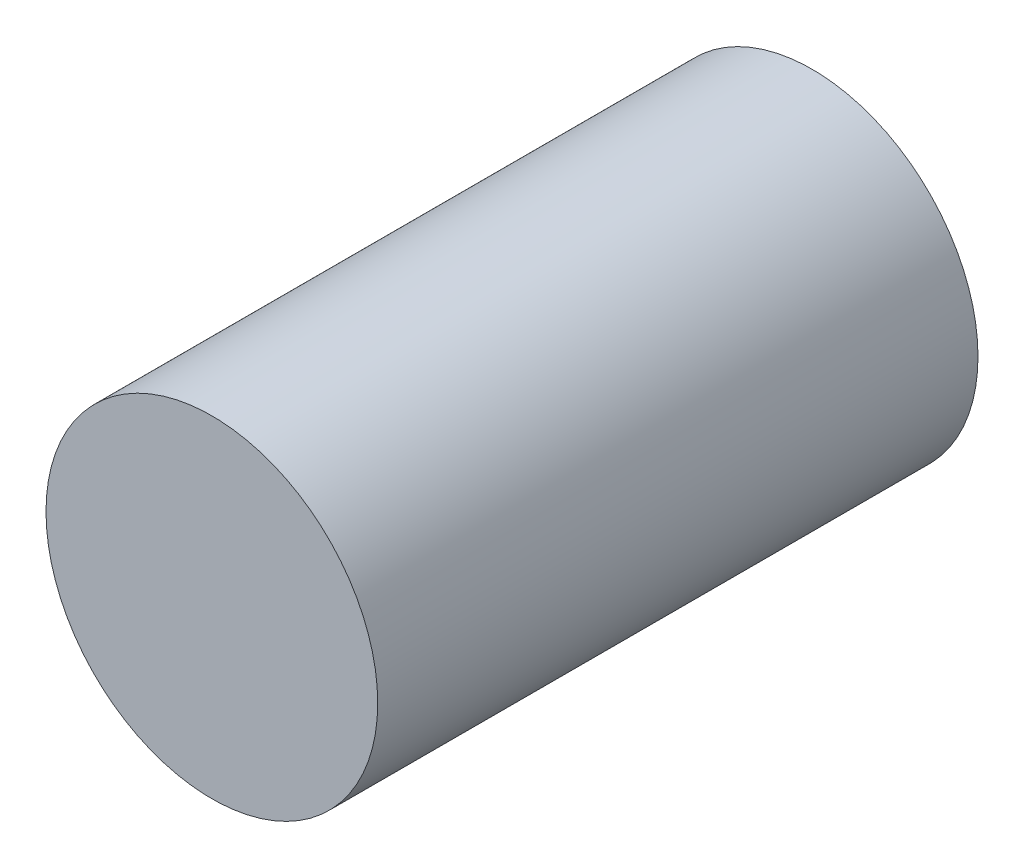
ISO-10303-21;
HEADER;
FILE_DESCRIPTION(('STEP AP214'),'2;1');
FILE_NAME('part.step','',(''),(''),'','','');
FILE_SCHEMA(('AUTOMOTIVE_DESIGN { 1 0 10303 214 1 1 1 1 }'));
ENDSEC;
DATA;
#1=APPLICATION_CONTEXT('core data for automotive mechanical design processes');
#2=APPLICATION_PROTOCOL_DEFINITION('international standard','automotive_design',2000,#1);
#3=PRODUCT_CONTEXT('',#1,'mechanical');
#4=PRODUCT('Part','Part','',(#3));
#5=PRODUCT_RELATED_PRODUCT_CATEGORY('part','',(#4));
#6=PRODUCT_DEFINITION_FORMATION('','',#4);
#7=PRODUCT_DEFINITION_CONTEXT('part definition',#1,'design');
#8=PRODUCT_DEFINITION('design','',#6,#7);
#9=PRODUCT_DEFINITION_SHAPE('','',#8);
#10=(LENGTH_UNIT() NAMED_UNIT(*) SI_UNIT(.MILLI.,.METRE.));
#11=(NAMED_UNIT(*) PLANE_ANGLE_UNIT() SI_UNIT($,.RADIAN.));
#12=(NAMED_UNIT(*) SI_UNIT($,.STERADIAN.) SOLID_ANGLE_UNIT());
#13=UNCERTAINTY_MEASURE_WITH_UNIT(LENGTH_MEASURE(1.E-05),#10,'distance_accuracy_value','');
#14=(GEOMETRIC_REPRESENTATION_CONTEXT(3) GLOBAL_UNCERTAINTY_ASSIGNED_CONTEXT((#13)) GLOBAL_UNIT_ASSIGNED_CONTEXT((#10,
#11,#12)) REPRESENTATION_CONTEXT('',''));
#15=CARTESIAN_POINT('',(0.,0.,0.));
#16=DIRECTION('',(0.,0.,1.));
#17=DIRECTION('',(1.,0.,0.));
#18=AXIS2_PLACEMENT_3D('',#15,#16,#17);
#19=CARTESIAN_POINT('',(0.,0.,9.50000000000001));
#20=DIRECTION('',(0.,0.,-0.999999999999998));
#21=DIRECTION('',(-1.,0.,0.));
#22=AXIS2_PLACEMENT_3D('',#19,#20,#21);
#23=CYLINDRICAL_SURFACE('',#22,2.625);
#24=CARTESIAN_POINT('',(0.,0.,9.50000000000001));
#25=DIRECTION('',(0.,0.,0.999999999999998));
#26=DIRECTION('',(1.,0.,0.));
#27=AXIS2_PLACEMENT_3D('',#24,#25,#26);
#28=CIRCLE('',#27,2.625);
#29=CARTESIAN_POINT('',(2.625,0.,9.50000000000001));
#30=VERTEX_POINT('',#29);
#31=EDGE_CURVE('E10',#30,#30,#28,.T.);
#32=ORIENTED_EDGE('',*,*,#31,.F.);
#33=EDGE_LOOP('',(#32));
#34=FACE_BOUND('',#33,.T.);
#35=CARTESIAN_POINT('',(0.,0.,0.));
#36=DIRECTION('',(0.,0.,0.999999999999998));
#37=DIRECTION('',(1.,0.,0.));
#38=AXIS2_PLACEMENT_3D('',#35,#36,#37);
#39=CIRCLE('',#38,2.625);
#40=CARTESIAN_POINT('',(2.625,0.,0.));
#41=VERTEX_POINT('',#40);
#42=EDGE_CURVE('E39',#41,#41,#39,.T.);
#43=ORIENTED_EDGE('',*,*,#42,.T.);
#44=EDGE_LOOP('',(#43));
#45=FACE_BOUND('',#44,.T.);
#46=ADVANCED_FACE('F36',(#34,#45),#23,.T.);
#47=CARTESIAN_POINT('',(0.,0.,9.50000000000001));
#48=DIRECTION('',(0.,0.,0.999999999999998));
#49=DIRECTION('',(1.,0.,0.));
#50=AXIS2_PLACEMENT_3D('',#47,#48,#49);
#51=PLANE('',#50);
#52=ORIENTED_EDGE('',*,*,#31,.T.);
#53=EDGE_LOOP('',(#52));
#54=FACE_BOUND('',#53,.T.);
#55=ADVANCED_FACE('F55',(#54),#51,.T.);
#56=CARTESIAN_POINT('',(0.,0.,0.));
#57=DIRECTION('',(0.,0.,0.999999999999998));
#58=DIRECTION('',(1.,0.,0.));
#59=AXIS2_PLACEMENT_3D('',#56,#57,#58);
#60=PLANE('',#59);
#61=ORIENTED_EDGE('',*,*,#42,.F.);
#62=EDGE_LOOP('',(#61));
#63=FACE_BOUND('',#62,.T.);
#64=ADVANCED_FACE('F53',(#63),#60,.F.);
#65=CLOSED_SHELL('',(#46,#55,#64));
#66=MANIFOLD_SOLID_BREP('B2',#65);
#67=ADVANCED_BREP_SHAPE_REPRESENTATION('',(#18,#66),#14);
#68=SHAPE_DEFINITION_REPRESENTATION(#9,#67);
ENDSEC;
END-ISO-10303-21;
